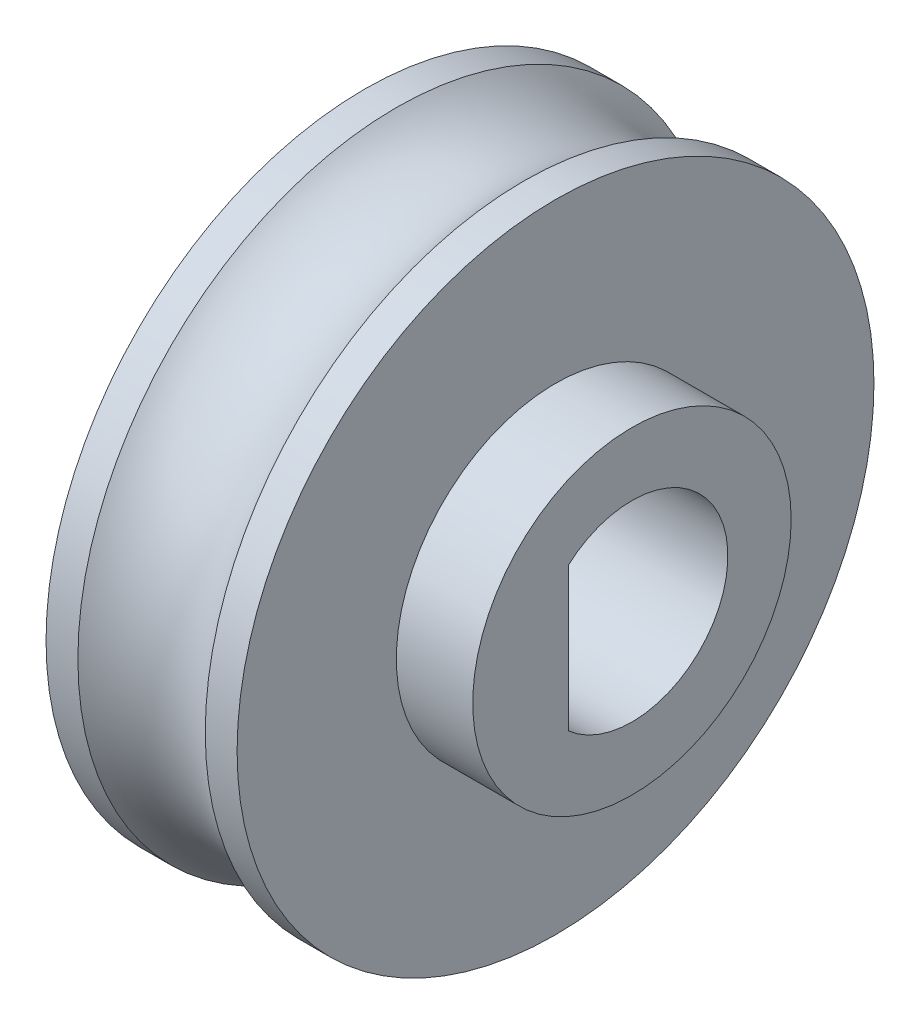
ISO-10303-21;
HEADER;
FILE_DESCRIPTION(('STEP AP214'),'2;1');
FILE_NAME('part.step','',(''),(''),'','','');
FILE_SCHEMA(('AUTOMOTIVE_DESIGN { 1 0 10303 214 1 1 1 1 }'));
ENDSEC;
DATA;
#1=APPLICATION_CONTEXT('core data for automotive mechanical design processes');
#2=APPLICATION_PROTOCOL_DEFINITION('international standard','automotive_design',2000,#1);
#3=PRODUCT_CONTEXT('',#1,'mechanical');
#4=PRODUCT('Part','Part','',(#3));
#5=PRODUCT_RELATED_PRODUCT_CATEGORY('part','',(#4));
#6=PRODUCT_DEFINITION_FORMATION('','',#4);
#7=PRODUCT_DEFINITION_CONTEXT('part definition',#1,'design');
#8=PRODUCT_DEFINITION('design','',#6,#7);
#9=PRODUCT_DEFINITION_SHAPE('','',#8);
#10=(LENGTH_UNIT() NAMED_UNIT(*) SI_UNIT(.MILLI.,.METRE.));
#11=(NAMED_UNIT(*) PLANE_ANGLE_UNIT() SI_UNIT($,.RADIAN.));
#12=(NAMED_UNIT(*) SI_UNIT($,.STERADIAN.) SOLID_ANGLE_UNIT());
#13=UNCERTAINTY_MEASURE_WITH_UNIT(LENGTH_MEASURE(1.E-05),#10,'distance_accuracy_value','');
#14=(GEOMETRIC_REPRESENTATION_CONTEXT(3) GLOBAL_UNCERTAINTY_ASSIGNED_CONTEXT((#13)) GLOBAL_UNIT_ASSIGNED_CONTEXT((#10,
#11,#12)) REPRESENTATION_CONTEXT('',''));
#15=CARTESIAN_POINT('',(0.,0.,0.));
#16=DIRECTION('',(0.,0.,1.));
#17=DIRECTION('',(1.,0.,0.));
#18=AXIS2_PLACEMENT_3D('',#15,#16,#17);
#19=CARTESIAN_POINT('',(-1.5,0.,0.));
#20=DIRECTION('',(1.,0.,0.));
#21=DIRECTION('',(0.,0.,-1.));
#22=AXIS2_PLACEMENT_3D('',#19,#20,#21);
#23=CYLINDRICAL_SURFACE('',#22,1.50591243381249);
#24=CARTESIAN_POINT('',(-0.5,0.,0.));
#25=DIRECTION('',(-1.,0.,0.));
#26=DIRECTION('',(0.,0.,1.));
#27=AXIS2_PLACEMENT_3D('',#24,#25,#26);
#28=CIRCLE('',#27,1.50591243381249);
#29=CARTESIAN_POINT('',(-0.5,-1.1259539325883,1.));
#30=VERTEX_POINT('',#29);
#31=CARTESIAN_POINT('',(-0.5,1.1259539325883,1.));
#32=VERTEX_POINT('',#31);
#33=EDGE_CURVE('E51',#30,#32,#28,.F.);
#34=ORIENTED_EDGE('',*,*,#33,.F.);
#35=DIRECTION('',(1.,0.,0.));
#36=VECTOR('',#35,1.);
#37=CARTESIAN_POINT('',(-1.5,-1.1259539325883,1.));
#38=LINE('',#37,#36);
#39=CARTESIAN_POINT('',(2.7,-1.1259539325883,1.));
#40=VERTEX_POINT('',#39);
#41=EDGE_CURVE('E67',#30,#40,#38,.T.);
#42=ORIENTED_EDGE('',*,*,#41,.T.);
#43=CARTESIAN_POINT('',(2.7,0.,0.));
#44=DIRECTION('',(1.,0.,0.));
#45=DIRECTION('',(0.,0.,-1.));
#46=AXIS2_PLACEMENT_3D('',#43,#44,#45);
#47=CIRCLE('',#46,1.50591243381249);
#48=CARTESIAN_POINT('',(2.7,1.1259539325883,1.));
#49=VERTEX_POINT('',#48);
#50=EDGE_CURVE('E68',#40,#49,#47,.T.);
#51=ORIENTED_EDGE('',*,*,#50,.T.);
#52=DIRECTION('',(1.,0.,0.));
#53=VECTOR('',#52,1.);
#54=CARTESIAN_POINT('',(-1.5,1.1259539325883,1.));
#55=LINE('',#54,#53);
#56=EDGE_CURVE('E58',#32,#49,#55,.T.);
#57=ORIENTED_EDGE('',*,*,#56,.F.);
#58=EDGE_LOOP('',(#34,#42,#51,#57));
#59=FACE_BOUND('',#58,.T.);
#60=ADVANCED_FACE('F38',(#59),#23,.F.);
#61=CARTESIAN_POINT('',(-1.5,1.1259539325883,1.));
#62=DIRECTION('',(0.,0.,1.));
#63=DIRECTION('',(1.,0.,0.));
#64=AXIS2_PLACEMENT_3D('',#61,#62,#63);
#65=PLANE('',#64);
#66=DIRECTION('',(0.,-1.,0.));
#67=VECTOR('',#66,1.);
#68=CARTESIAN_POINT('',(-0.5,1.1259539325883,1.));
#69=LINE('',#68,#67);
#70=EDGE_CURVE('E11',#32,#30,#69,.T.);
#71=ORIENTED_EDGE('',*,*,#70,.F.);
#72=ORIENTED_EDGE('',*,*,#56,.T.);
#73=DIRECTION('',(0.,-1.,0.));
#74=VECTOR('',#73,1.);
#75=CARTESIAN_POINT('',(2.7,1.1259539325883,1.));
#76=LINE('',#75,#74);
#77=EDGE_CURVE('E73',#49,#40,#76,.T.);
#78=ORIENTED_EDGE('',*,*,#77,.T.);
#79=ORIENTED_EDGE('',*,*,#41,.F.);
#80=EDGE_LOOP('',(#71,#72,#78,#79));
#81=FACE_BOUND('',#80,.T.);
#82=ADVANCED_FACE('F71',(#81),#65,.F.);
#83=CARTESIAN_POINT('',(1.5,0.,0.));
#84=DIRECTION('',(-1.,0.,0.));
#85=DIRECTION('',(0.,0.,1.));
#86=AXIS2_PLACEMENT_3D('',#83,#84,#85);
#87=PLANE('',#86);
#88=CARTESIAN_POINT('',(1.5,0.,0.));
#89=DIRECTION('',(1.,0.,0.));
#90=DIRECTION('',(0.,0.,-1.));
#91=AXIS2_PLACEMENT_3D('',#88,#89,#90);
#92=CIRCLE('',#91,2.5);
#93=CARTESIAN_POINT('',(1.5,0.,-2.5));
#94=VERTEX_POINT('',#93);
#95=EDGE_CURVE('E46',#94,#94,#92,.T.);
#96=ORIENTED_EDGE('',*,*,#95,.F.);
#97=EDGE_LOOP('',(#96));
#98=FACE_BOUND('',#97,.T.);
#99=CARTESIAN_POINT('',(1.5,0.,0.));
#100=DIRECTION('',(-1.,0.,0.));
#101=DIRECTION('',(0.,0.,1.));
#102=AXIS2_PLACEMENT_3D('',#99,#100,#101);
#103=CIRCLE('',#102,5.);
#104=CARTESIAN_POINT('',(1.5,0.,5.));
#105=VERTEX_POINT('',#104);
#106=EDGE_CURVE('E78',#105,#105,#103,.T.);
#107=ORIENTED_EDGE('',*,*,#106,.F.);
#108=EDGE_LOOP('',(#107));
#109=FACE_BOUND('',#108,.T.);
#110=ADVANCED_FACE('F40',(#98,#109),#87,.F.);
#111=CARTESIAN_POINT('',(-1.5,0.,0.));
#112=DIRECTION('',(1.,0.,0.));
#113=DIRECTION('',(0.,0.,-1.));
#114=AXIS2_PLACEMENT_3D('',#111,#112,#113);
#115=PLANE('',#114);
#116=CARTESIAN_POINT('',(-1.5,0.,0.));
#117=DIRECTION('',(-1.,0.,0.));
#118=DIRECTION('',(0.,0.,1.));
#119=AXIS2_PLACEMENT_3D('',#116,#117,#118);
#120=CIRCLE('',#119,3.5);
#121=CARTESIAN_POINT('',(-1.5,0.,3.5));
#122=VERTEX_POINT('',#121);
#123=EDGE_CURVE('E215',#122,#122,#120,.T.);
#124=ORIENTED_EDGE('',*,*,#123,.F.);
#125=EDGE_LOOP('',(#124));
#126=FACE_BOUND('',#125,.T.);
#127=CARTESIAN_POINT('',(-1.5,0.,0.));
#128=DIRECTION('',(-1.,0.,0.));
#129=DIRECTION('',(0.,0.,1.));
#130=AXIS2_PLACEMENT_3D('',#127,#128,#129);
#131=CIRCLE('',#130,5.);
#132=CARTESIAN_POINT('',(-1.5,0.,5.));
#133=VERTEX_POINT('',#132);
#134=EDGE_CURVE('E86',#133,#133,#131,.T.);
#135=ORIENTED_EDGE('',*,*,#134,.T.);
#136=EDGE_LOOP('',(#135));
#137=FACE_BOUND('',#136,.T.);
#138=ADVANCED_FACE('F97',(#126,#137),#115,.F.);
#139=CARTESIAN_POINT('',(0.,0.,0.));
#140=DIRECTION('',(-1.,0.,0.));
#141=DIRECTION('',(0.,0.,1.));
#142=AXIS2_PLACEMENT_3D('',#139,#140,#141);
#143=CYLINDRICAL_SURFACE('',#142,5.);
#144=ORIENTED_EDGE('',*,*,#134,.F.);
#145=EDGE_LOOP('',(#144));
#146=FACE_BOUND('',#145,.T.);
#147=CARTESIAN_POINT('',(-1.,0.,0.));
#148=DIRECTION('',(-1.,0.,0.));
#149=DIRECTION('',(0.,0.,1.));
#150=AXIS2_PLACEMENT_3D('',#147,#148,#149);
#151=CIRCLE('',#150,5.);
#152=CARTESIAN_POINT('',(-1.,0.,5.));
#153=VERTEX_POINT('',#152);
#154=EDGE_CURVE('E92',#153,#153,#151,.T.);
#155=ORIENTED_EDGE('',*,*,#154,.T.);
#156=EDGE_LOOP('',(#155));
#157=FACE_BOUND('',#156,.T.);
#158=ADVANCED_FACE('F99',(#146,#157),#143,.T.);
#159=CARTESIAN_POINT('',(0.,0.,0.));
#160=DIRECTION('',(-1.,0.,0.));
#161=DIRECTION('',(0.,0.,1.));
#162=AXIS2_PLACEMENT_3D('',#159,#160,#161);
#163=TOROIDAL_SURFACE('',#162,6.11803398874989,1.5);
#164=ORIENTED_EDGE('',*,*,#154,.F.);
#165=EDGE_LOOP('',(#164));
#166=FACE_BOUND('',#165,.T.);
#167=CARTESIAN_POINT('',(1.,0.,0.));
#168=DIRECTION('',(-1.,0.,0.));
#169=DIRECTION('',(0.,0.,1.));
#170=AXIS2_PLACEMENT_3D('',#167,#168,#169);
#171=CIRCLE('',#170,5.);
#172=CARTESIAN_POINT('',(1.,0.,5.));
#173=VERTEX_POINT('',#172);
#174=EDGE_CURVE('E89',#173,#173,#171,.T.);
#175=ORIENTED_EDGE('',*,*,#174,.T.);
#176=EDGE_LOOP('',(#175));
#177=FACE_BOUND('',#176,.T.);
#178=ADVANCED_FACE('F102',(#166,#177),#163,.F.);
#179=CARTESIAN_POINT('',(0.,0.,0.));
#180=DIRECTION('',(-1.,0.,0.));
#181=DIRECTION('',(0.,0.,1.));
#182=AXIS2_PLACEMENT_3D('',#179,#180,#181);
#183=CYLINDRICAL_SURFACE('',#182,5.);
#184=ORIENTED_EDGE('',*,*,#174,.F.);
#185=EDGE_LOOP('',(#184));
#186=FACE_BOUND('',#185,.T.);
#187=ORIENTED_EDGE('',*,*,#106,.T.);
#188=EDGE_LOOP('',(#187));
#189=FACE_BOUND('',#188,.T.);
#190=ADVANCED_FACE('F108',(#186,#189),#183,.T.);
#191=CARTESIAN_POINT('',(2.7,0.,0.));
#192=DIRECTION('',(-1.,0.,0.));
#193=DIRECTION('',(0.,0.,1.));
#194=AXIS2_PLACEMENT_3D('',#191,#192,#193);
#195=CYLINDRICAL_SURFACE('',#194,2.5);
#196=CARTESIAN_POINT('',(2.7,0.,0.));
#197=DIRECTION('',(1.,0.,0.));
#198=DIRECTION('',(0.,0.,-1.));
#199=AXIS2_PLACEMENT_3D('',#196,#197,#198);
#200=CIRCLE('',#199,2.5);
#201=CARTESIAN_POINT('',(2.7,0.,-2.5));
#202=VERTEX_POINT('',#201);
#203=EDGE_CURVE('E75',#202,#202,#200,.T.);
#204=ORIENTED_EDGE('',*,*,#203,.F.);
#205=EDGE_LOOP('',(#204));
#206=FACE_BOUND('',#205,.T.);
#207=ORIENTED_EDGE('',*,*,#95,.T.);
#208=EDGE_LOOP('',(#207));
#209=FACE_BOUND('',#208,.T.);
#210=ADVANCED_FACE('F114',(#206,#209),#195,.T.);
#211=CARTESIAN_POINT('',(2.7,0.,0.));
#212=DIRECTION('',(1.,0.,0.));
#213=DIRECTION('',(0.,0.,-1.));
#214=AXIS2_PLACEMENT_3D('',#211,#212,#213);
#215=PLANE('',#214);
#216=ORIENTED_EDGE('',*,*,#50,.F.);
#217=ORIENTED_EDGE('',*,*,#77,.F.);
#218=EDGE_LOOP('',(#216,#217));
#219=FACE_BOUND('',#218,.T.);
#220=ORIENTED_EDGE('',*,*,#203,.T.);
#221=EDGE_LOOP('',(#220));
#222=FACE_BOUND('',#221,.T.);
#223=ADVANCED_FACE('F133',(#219,#222),#215,.T.);
#224=CARTESIAN_POINT('',(-0.5,0.,0.));
#225=DIRECTION('',(-1.,0.,0.));
#226=DIRECTION('',(0.,0.,1.));
#227=AXIS2_PLACEMENT_3D('',#224,#225,#226);
#228=PLANE('',#227);
#229=CARTESIAN_POINT('',(-0.5,0.,0.));
#230=DIRECTION('',(-1.,0.,0.));
#231=DIRECTION('',(0.,0.,1.));
#232=AXIS2_PLACEMENT_3D('',#229,#230,#231);
#233=CIRCLE('',#232,3.5);
#234=CARTESIAN_POINT('',(-0.5,0.,3.5));
#235=VERTEX_POINT('',#234);
#236=EDGE_CURVE('E69',#235,#235,#233,.T.);
#237=ORIENTED_EDGE('',*,*,#236,.T.);
#238=EDGE_LOOP('',(#237));
#239=FACE_BOUND('',#238,.T.);
#240=ORIENTED_EDGE('',*,*,#33,.T.);
#241=ORIENTED_EDGE('',*,*,#70,.T.);
#242=EDGE_LOOP('',(#240,#241));
#243=FACE_BOUND('',#242,.T.);
#244=ADVANCED_FACE('F64',(#239,#243),#228,.T.);
#245=CARTESIAN_POINT('',(-0.5,0.,0.));
#246=DIRECTION('',(-1.,0.,0.));
#247=DIRECTION('',(0.,0.,1.));
#248=AXIS2_PLACEMENT_3D('',#245,#246,#247);
#249=CYLINDRICAL_SURFACE('',#248,3.5);
#250=ORIENTED_EDGE('',*,*,#236,.F.);
#251=EDGE_LOOP('',(#250));
#252=FACE_BOUND('',#251,.T.);
#253=ORIENTED_EDGE('',*,*,#123,.T.);
#254=EDGE_LOOP('',(#253));
#255=FACE_BOUND('',#254,.T.);
#256=ADVANCED_FACE('F156',(#252,#255),#249,.F.);
#257=CLOSED_SHELL('',(#60,#82,#110,#138,#158,#178,#190,#210,#223,#244,#256));
#258=MANIFOLD_SOLID_BREP('B2',#257);
#259=ADVANCED_BREP_SHAPE_REPRESENTATION('',(#18,#258),#14);
#260=SHAPE_DEFINITION_REPRESENTATION(#9,#259);
ENDSEC;
END-ISO-10303-21;
